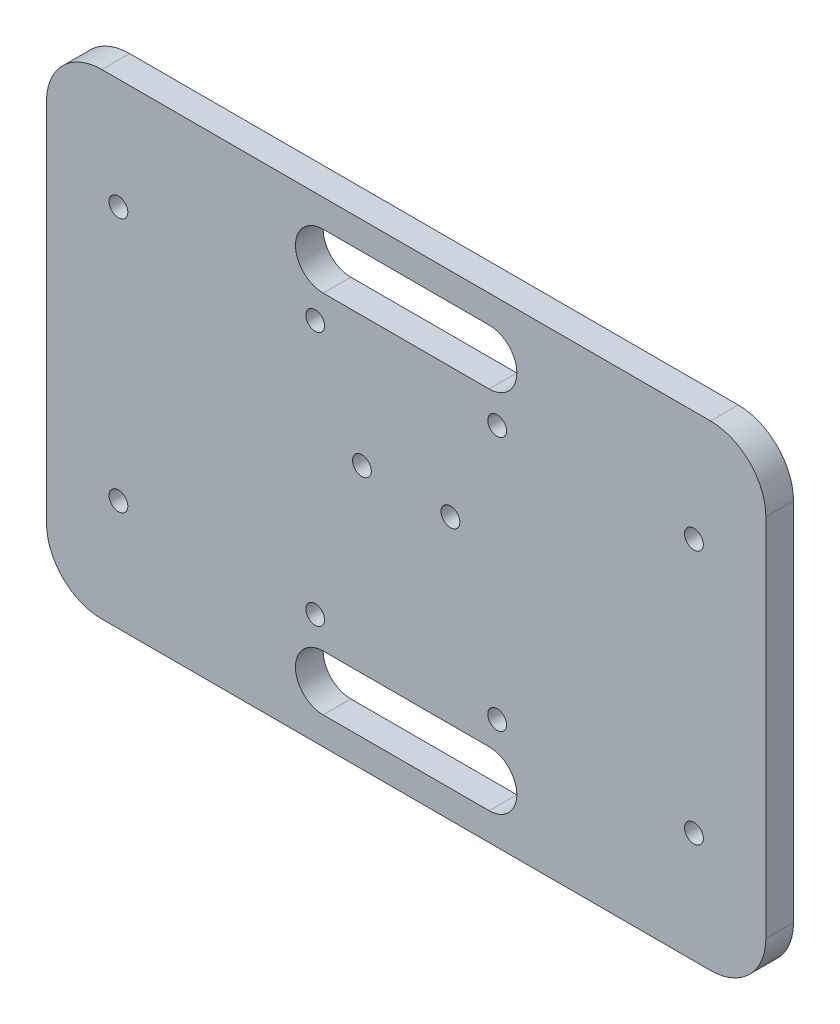
ISO-10303-21;
HEADER;
FILE_DESCRIPTION(('STEP AP214'),'2;1');
FILE_NAME('part.step','',(''),(''),'','','');
FILE_SCHEMA(('AUTOMOTIVE_DESIGN { 1 0 10303 214 1 1 1 1 }'));
ENDSEC;
DATA;
#1=APPLICATION_CONTEXT('core data for automotive mechanical design processes');
#2=APPLICATION_PROTOCOL_DEFINITION('international standard','automotive_design',2000,#1);
#3=PRODUCT_CONTEXT('',#1,'mechanical');
#4=PRODUCT('Part','Part','',(#3));
#5=PRODUCT_RELATED_PRODUCT_CATEGORY('part','',(#4));
#6=PRODUCT_DEFINITION_FORMATION('','',#4);
#7=PRODUCT_DEFINITION_CONTEXT('part definition',#1,'design');
#8=PRODUCT_DEFINITION('design','',#6,#7);
#9=PRODUCT_DEFINITION_SHAPE('','',#8);
#10=(LENGTH_UNIT() NAMED_UNIT(*) SI_UNIT(.MILLI.,.METRE.));
#11=(NAMED_UNIT(*) PLANE_ANGLE_UNIT() SI_UNIT($,.RADIAN.));
#12=(NAMED_UNIT(*) SI_UNIT($,.STERADIAN.) SOLID_ANGLE_UNIT());
#13=UNCERTAINTY_MEASURE_WITH_UNIT(LENGTH_MEASURE(1.E-05),#10,'distance_accuracy_value','');
#14=(GEOMETRIC_REPRESENTATION_CONTEXT(3) GLOBAL_UNCERTAINTY_ASSIGNED_CONTEXT((#13)) GLOBAL_UNIT_ASSIGNED_CONTEXT((#10,
#11,#12)) REPRESENTATION_CONTEXT('',''));
#15=CARTESIAN_POINT('',(0.,0.,0.));
#16=DIRECTION('',(0.,0.,1.));
#17=DIRECTION('',(1.,0.,0.));
#18=AXIS2_PLACEMENT_3D('',#15,#16,#17);
#19=CARTESIAN_POINT('',(15.,33.,5.));
#20=DIRECTION('',(0.,0.,-1.));
#21=DIRECTION('',(-1.,0.,0.));
#22=AXIS2_PLACEMENT_3D('',#19,#20,#21);
#23=CYLINDRICAL_SURFACE('',#22,5.);
#24=CARTESIAN_POINT('',(15.,33.,0.));
#25=DIRECTION('',(0.,0.,1.));
#26=DIRECTION('',(1.,0.,0.));
#27=AXIS2_PLACEMENT_3D('',#24,#25,#26);
#28=CIRCLE('',#27,5.);
#29=CARTESIAN_POINT('',(15.,28.,0.));
#30=VERTEX_POINT('',#29);
#31=CARTESIAN_POINT('',(15.,38.,0.));
#32=VERTEX_POINT('',#31);
#33=EDGE_CURVE('E249',#30,#32,#28,.T.);
#34=ORIENTED_EDGE('',*,*,#33,.F.);
#35=DIRECTION('',(0.,0.,-1.));
#36=VECTOR('',#35,1.);
#37=CARTESIAN_POINT('',(15.,28.,5.));
#38=LINE('',#37,#36);
#39=CARTESIAN_POINT('',(15.,28.,5.));
#40=VERTEX_POINT('',#39);
#41=EDGE_CURVE('E11',#40,#30,#38,.T.);
#42=ORIENTED_EDGE('',*,*,#41,.F.);
#43=CARTESIAN_POINT('',(15.,33.,5.));
#44=DIRECTION('',(0.,0.,1.));
#45=DIRECTION('',(1.,0.,0.));
#46=AXIS2_PLACEMENT_3D('',#43,#44,#45);
#47=CIRCLE('',#46,5.);
#48=CARTESIAN_POINT('',(15.,38.,5.));
#49=VERTEX_POINT('',#48);
#50=EDGE_CURVE('E176',#40,#49,#47,.T.);
#51=ORIENTED_EDGE('',*,*,#50,.T.);
#52=DIRECTION('',(0.,0.,-1.));
#53=VECTOR('',#52,1.);
#54=CARTESIAN_POINT('',(15.,38.,5.));
#55=LINE('',#54,#53);
#56=EDGE_CURVE('E116',#49,#32,#55,.T.);
#57=ORIENTED_EDGE('',*,*,#56,.T.);
#58=EDGE_LOOP('',(#34,#42,#51,#57));
#59=FACE_BOUND('',#58,.T.);
#60=ADVANCED_FACE('F39',(#59),#23,.F.);
#61=CARTESIAN_POINT('',(0.,28.,5.));
#62=DIRECTION('',(0.,1.,0.));
#63=DIRECTION('',(-1.,0.,0.));
#64=AXIS2_PLACEMENT_3D('',#61,#62,#63);
#65=PLANE('',#64);
#66=DIRECTION('',(1.,0.,0.));
#67=VECTOR('',#66,1.);
#68=CARTESIAN_POINT('',(0.,28.,0.));
#69=LINE('',#68,#67);
#70=CARTESIAN_POINT('',(-15.,28.,0.));
#71=VERTEX_POINT('',#70);
#72=EDGE_CURVE('E168',#71,#30,#69,.T.);
#73=ORIENTED_EDGE('',*,*,#72,.F.);
#74=DIRECTION('',(0.,0.,-1.));
#75=VECTOR('',#74,1.);
#76=CARTESIAN_POINT('',(-15.,28.,5.));
#77=LINE('',#76,#75);
#78=CARTESIAN_POINT('',(-15.,28.,5.));
#79=VERTEX_POINT('',#78);
#80=EDGE_CURVE('E49',#79,#71,#77,.T.);
#81=ORIENTED_EDGE('',*,*,#80,.F.);
#82=DIRECTION('',(1.,0.,0.));
#83=VECTOR('',#82,1.);
#84=CARTESIAN_POINT('',(0.,28.,5.));
#85=LINE('',#84,#83);
#86=EDGE_CURVE('E166',#79,#40,#85,.T.);
#87=ORIENTED_EDGE('',*,*,#86,.T.);
#88=ORIENTED_EDGE('',*,*,#41,.T.);
#89=EDGE_LOOP('',(#73,#81,#87,#88));
#90=FACE_BOUND('',#89,.T.);
#91=ADVANCED_FACE('F165',(#90),#65,.T.);
#92=CARTESIAN_POINT('',(-15.,33.,5.));
#93=DIRECTION('',(0.,0.,-1.));
#94=DIRECTION('',(-1.,0.,0.));
#95=AXIS2_PLACEMENT_3D('',#92,#93,#94);
#96=CYLINDRICAL_SURFACE('',#95,5.);
#97=CARTESIAN_POINT('',(-15.,33.,0.));
#98=DIRECTION('',(0.,0.,1.));
#99=DIRECTION('',(1.,0.,0.));
#100=AXIS2_PLACEMENT_3D('',#97,#98,#99);
#101=CIRCLE('',#100,5.);
#102=CARTESIAN_POINT('',(-15.,38.,0.));
#103=VERTEX_POINT('',#102);
#104=EDGE_CURVE('E253',#103,#71,#101,.T.);
#105=ORIENTED_EDGE('',*,*,#104,.F.);
#106=DIRECTION('',(0.,0.,-1.));
#107=VECTOR('',#106,1.);
#108=CARTESIAN_POINT('',(-15.,38.,5.));
#109=LINE('',#108,#107);
#110=CARTESIAN_POINT('',(-15.,38.,5.));
#111=VERTEX_POINT('',#110);
#112=EDGE_CURVE('E109',#111,#103,#109,.T.);
#113=ORIENTED_EDGE('',*,*,#112,.F.);
#114=CARTESIAN_POINT('',(-15.,33.,5.));
#115=DIRECTION('',(0.,0.,1.));
#116=DIRECTION('',(1.,0.,0.));
#117=AXIS2_PLACEMENT_3D('',#114,#115,#116);
#118=CIRCLE('',#117,5.);
#119=EDGE_CURVE('E175',#111,#79,#118,.T.);
#120=ORIENTED_EDGE('',*,*,#119,.T.);
#121=ORIENTED_EDGE('',*,*,#80,.T.);
#122=EDGE_LOOP('',(#105,#113,#120,#121));
#123=FACE_BOUND('',#122,.T.);
#124=ADVANCED_FACE('F178',(#123),#96,.F.);
#125=CARTESIAN_POINT('',(15.0000000000001,-33.,5.));
#126=DIRECTION('',(0.,0.,-1.));
#127=DIRECTION('',(-1.,0.,0.));
#128=AXIS2_PLACEMENT_3D('',#125,#126,#127);
#129=CYLINDRICAL_SURFACE('',#128,5.);
#130=CARTESIAN_POINT('',(15.0000000000001,-33.,0.));
#131=DIRECTION('',(0.,0.,1.));
#132=DIRECTION('',(1.,0.,0.));
#133=AXIS2_PLACEMENT_3D('',#130,#131,#132);
#134=CIRCLE('',#133,5.);
#135=CARTESIAN_POINT('',(15.0000000000001,-38.,0.));
#136=VERTEX_POINT('',#135);
#137=CARTESIAN_POINT('',(15.0000000000001,-28.,0.));
#138=VERTEX_POINT('',#137);
#139=EDGE_CURVE('E237',#136,#138,#134,.T.);
#140=ORIENTED_EDGE('',*,*,#139,.F.);
#141=DIRECTION('',(0.,0.,-1.));
#142=VECTOR('',#141,1.);
#143=CARTESIAN_POINT('',(15.0000000000001,-38.,5.));
#144=LINE('',#143,#142);
#145=CARTESIAN_POINT('',(15.0000000000001,-38.,5.));
#146=VERTEX_POINT('',#145);
#147=EDGE_CURVE('E259',#146,#136,#144,.T.);
#148=ORIENTED_EDGE('',*,*,#147,.F.);
#149=CARTESIAN_POINT('',(15.0000000000001,-33.,5.));
#150=DIRECTION('',(0.,0.,1.));
#151=DIRECTION('',(1.,0.,0.));
#152=AXIS2_PLACEMENT_3D('',#149,#150,#151);
#153=CIRCLE('',#152,5.);
#154=CARTESIAN_POINT('',(15.0000000000001,-28.,5.));
#155=VERTEX_POINT('',#154);
#156=EDGE_CURVE('E320',#146,#155,#153,.T.);
#157=ORIENTED_EDGE('',*,*,#156,.T.);
#158=DIRECTION('',(0.,0.,-1.));
#159=VECTOR('',#158,1.);
#160=CARTESIAN_POINT('',(15.0000000000001,-28.,5.));
#161=LINE('',#160,#159);
#162=EDGE_CURVE('E261',#155,#138,#161,.T.);
#163=ORIENTED_EDGE('',*,*,#162,.T.);
#164=EDGE_LOOP('',(#140,#148,#157,#163));
#165=FACE_BOUND('',#164,.T.);
#166=ADVANCED_FACE('F364',(#165),#129,.F.);
#167=CARTESIAN_POINT('',(0.,-38.,5.));
#168=DIRECTION('',(0.,1.,0.));
#169=DIRECTION('',(-1.,0.,0.));
#170=AXIS2_PLACEMENT_3D('',#167,#168,#169);
#171=PLANE('',#170);
#172=DIRECTION('',(1.,0.,0.));
#173=VECTOR('',#172,1.);
#174=CARTESIAN_POINT('',(0.,-38.,0.));
#175=LINE('',#174,#173);
#176=CARTESIAN_POINT('',(-15.,-38.,0.));
#177=VERTEX_POINT('',#176);
#178=EDGE_CURVE('E240',#177,#136,#175,.T.);
#179=ORIENTED_EDGE('',*,*,#178,.F.);
#180=DIRECTION('',(0.,0.,-1.));
#181=VECTOR('',#180,1.);
#182=CARTESIAN_POINT('',(-15.,-38.,5.));
#183=LINE('',#182,#181);
#184=CARTESIAN_POINT('',(-15.,-38.,5.));
#185=VERTEX_POINT('',#184);
#186=EDGE_CURVE('E265',#185,#177,#183,.T.);
#187=ORIENTED_EDGE('',*,*,#186,.F.);
#188=DIRECTION('',(1.,0.,0.));
#189=VECTOR('',#188,1.);
#190=CARTESIAN_POINT('',(0.,-38.,5.));
#191=LINE('',#190,#189);
#192=EDGE_CURVE('E323',#185,#146,#191,.T.);
#193=ORIENTED_EDGE('',*,*,#192,.T.);
#194=ORIENTED_EDGE('',*,*,#147,.T.);
#195=EDGE_LOOP('',(#179,#187,#193,#194));
#196=FACE_BOUND('',#195,.T.);
#197=ADVANCED_FACE('F360',(#196),#171,.T.);
#198=CARTESIAN_POINT('',(-15.,-33.,5.));
#199=DIRECTION('',(0.,0.,-1.));
#200=DIRECTION('',(-1.,0.,0.));
#201=AXIS2_PLACEMENT_3D('',#198,#199,#200);
#202=CYLINDRICAL_SURFACE('',#201,5.);
#203=CARTESIAN_POINT('',(-15.,-33.,0.));
#204=DIRECTION('',(0.,0.,1.));
#205=DIRECTION('',(1.,0.,0.));
#206=AXIS2_PLACEMENT_3D('',#203,#204,#205);
#207=CIRCLE('',#206,5.);
#208=CARTESIAN_POINT('',(-15.,-28.,0.));
#209=VERTEX_POINT('',#208);
#210=EDGE_CURVE('E243',#209,#177,#207,.T.);
#211=ORIENTED_EDGE('',*,*,#210,.F.);
#212=DIRECTION('',(0.,0.,-1.));
#213=VECTOR('',#212,1.);
#214=CARTESIAN_POINT('',(-15.,-28.,5.));
#215=LINE('',#214,#213);
#216=CARTESIAN_POINT('',(-15.,-28.,5.));
#217=VERTEX_POINT('',#216);
#218=EDGE_CURVE('E263',#217,#209,#215,.T.);
#219=ORIENTED_EDGE('',*,*,#218,.F.);
#220=CARTESIAN_POINT('',(-15.,-33.,5.));
#221=DIRECTION('',(0.,0.,1.));
#222=DIRECTION('',(1.,0.,0.));
#223=AXIS2_PLACEMENT_3D('',#220,#221,#222);
#224=CIRCLE('',#223,5.);
#225=EDGE_CURVE('E326',#217,#185,#224,.T.);
#226=ORIENTED_EDGE('',*,*,#225,.T.);
#227=ORIENTED_EDGE('',*,*,#186,.T.);
#228=EDGE_LOOP('',(#211,#219,#226,#227));
#229=FACE_BOUND('',#228,.T.);
#230=ADVANCED_FACE('F357',(#229),#202,.F.);
#231=CARTESIAN_POINT('',(55.,-33.,5.));
#232=DIRECTION('',(0.,0.,-1.));
#233=DIRECTION('',(-1.,0.,0.));
#234=AXIS2_PLACEMENT_3D('',#231,#232,#233);
#235=CYLINDRICAL_SURFACE('',#234,10.);
#236=CARTESIAN_POINT('',(55.,-33.,0.));
#237=DIRECTION('',(0.,0.,1.));
#238=DIRECTION('',(1.,0.,0.));
#239=AXIS2_PLACEMENT_3D('',#236,#237,#238);
#240=CIRCLE('',#239,10.);
#241=CARTESIAN_POINT('',(55.,-43.,0.));
#242=VERTEX_POINT('',#241);
#243=CARTESIAN_POINT('',(65.,-33.,0.));
#244=VERTEX_POINT('',#243);
#245=EDGE_CURVE('E214',#242,#244,#240,.T.);
#246=ORIENTED_EDGE('',*,*,#245,.T.);
#247=DIRECTION('',(0.,0.,-1.));
#248=VECTOR('',#247,1.);
#249=CARTESIAN_POINT('',(65.,-33.,5.));
#250=LINE('',#249,#248);
#251=CARTESIAN_POINT('',(65.,-33.,5.));
#252=VERTEX_POINT('',#251);
#253=EDGE_CURVE('E43',#252,#244,#250,.T.);
#254=ORIENTED_EDGE('',*,*,#253,.F.);
#255=CARTESIAN_POINT('',(55.,-33.,5.));
#256=DIRECTION('',(0.,0.,1.));
#257=DIRECTION('',(1.,0.,0.));
#258=AXIS2_PLACEMENT_3D('',#255,#256,#257);
#259=CIRCLE('',#258,10.);
#260=CARTESIAN_POINT('',(55.,-43.,5.));
#261=VERTEX_POINT('',#260);
#262=EDGE_CURVE('E124',#261,#252,#259,.T.);
#263=ORIENTED_EDGE('',*,*,#262,.F.);
#264=DIRECTION('',(0.,0.,-1.));
#265=VECTOR('',#264,1.);
#266=CARTESIAN_POINT('',(55.,-43.,5.));
#267=LINE('',#266,#265);
#268=EDGE_CURVE('E180',#261,#242,#267,.T.);
#269=ORIENTED_EDGE('',*,*,#268,.T.);
#270=EDGE_LOOP('',(#246,#254,#263,#269));
#271=FACE_BOUND('',#270,.T.);
#272=ADVANCED_FACE('F290',(#271),#235,.T.);
#273=CARTESIAN_POINT('',(65.,0.,5.));
#274=DIRECTION('',(1.,0.,0.));
#275=DIRECTION('',(0.,1.,0.));
#276=AXIS2_PLACEMENT_3D('',#273,#274,#275);
#277=PLANE('',#276);
#278=DIRECTION('',(0.,-1.,0.));
#279=VECTOR('',#278,1.);
#280=CARTESIAN_POINT('',(65.,0.,0.));
#281=LINE('',#280,#279);
#282=CARTESIAN_POINT('',(65.,33.,0.));
#283=VERTEX_POINT('',#282);
#284=EDGE_CURVE('E217',#283,#244,#281,.T.);
#285=ORIENTED_EDGE('',*,*,#284,.F.);
#286=DIRECTION('',(0.,0.,-1.));
#287=VECTOR('',#286,1.);
#288=CARTESIAN_POINT('',(65.,33.,5.));
#289=LINE('',#288,#287);
#290=CARTESIAN_POINT('',(65.,33.,5.));
#291=VERTEX_POINT('',#290);
#292=EDGE_CURVE('E279',#291,#283,#289,.T.);
#293=ORIENTED_EDGE('',*,*,#292,.F.);
#294=DIRECTION('',(0.,-1.,0.));
#295=VECTOR('',#294,1.);
#296=CARTESIAN_POINT('',(65.,0.,5.));
#297=LINE('',#296,#295);
#298=EDGE_CURVE('E287',#291,#252,#297,.T.);
#299=ORIENTED_EDGE('',*,*,#298,.T.);
#300=ORIENTED_EDGE('',*,*,#253,.T.);
#301=EDGE_LOOP('',(#285,#293,#299,#300));
#302=FACE_BOUND('',#301,.T.);
#303=ADVANCED_FACE('F286',(#302),#277,.T.);
#304=CARTESIAN_POINT('',(55.,33.,5.));
#305=DIRECTION('',(0.,0.,-1.));
#306=DIRECTION('',(-1.,0.,0.));
#307=AXIS2_PLACEMENT_3D('',#304,#305,#306);
#308=CYLINDRICAL_SURFACE('',#307,10.);
#309=CARTESIAN_POINT('',(55.,33.,0.));
#310=DIRECTION('',(0.,0.,1.));
#311=DIRECTION('',(1.,0.,0.));
#312=AXIS2_PLACEMENT_3D('',#309,#310,#311);
#313=CIRCLE('',#312,10.);
#314=CARTESIAN_POINT('',(55.,43.,0.));
#315=VERTEX_POINT('',#314);
#316=EDGE_CURVE('E220',#283,#315,#313,.T.);
#317=ORIENTED_EDGE('',*,*,#316,.T.);
#318=DIRECTION('',(0.,0.,-1.));
#319=VECTOR('',#318,1.);
#320=CARTESIAN_POINT('',(55.,43.,5.));
#321=LINE('',#320,#319);
#322=CARTESIAN_POINT('',(55.,43.,5.));
#323=VERTEX_POINT('',#322);
#324=EDGE_CURVE('E278',#323,#315,#321,.T.);
#325=ORIENTED_EDGE('',*,*,#324,.F.);
#326=CARTESIAN_POINT('',(55.,33.,5.));
#327=DIRECTION('',(0.,0.,1.));
#328=DIRECTION('',(1.,0.,0.));
#329=AXIS2_PLACEMENT_3D('',#326,#327,#328);
#330=CIRCLE('',#329,10.);
#331=EDGE_CURVE('E300',#291,#323,#330,.T.);
#332=ORIENTED_EDGE('',*,*,#331,.F.);
#333=ORIENTED_EDGE('',*,*,#292,.T.);
#334=EDGE_LOOP('',(#317,#325,#332,#333));
#335=FACE_BOUND('',#334,.T.);
#336=ADVANCED_FACE('F298',(#335),#308,.T.);
#337=CARTESIAN_POINT('',(0.,43.,5.));
#338=DIRECTION('',(0.,1.,0.));
#339=DIRECTION('',(-1.,0.,0.));
#340=AXIS2_PLACEMENT_3D('',#337,#338,#339);
#341=PLANE('',#340);
#342=DIRECTION('',(1.,0.,0.));
#343=VECTOR('',#342,1.);
#344=CARTESIAN_POINT('',(0.,43.,0.));
#345=LINE('',#344,#343);
#346=CARTESIAN_POINT('',(-55.,43.,0.));
#347=VERTEX_POINT('',#346);
#348=EDGE_CURVE('E223',#347,#315,#345,.T.);
#349=ORIENTED_EDGE('',*,*,#348,.F.);
#350=DIRECTION('',(0.,0.,-1.));
#351=VECTOR('',#350,1.);
#352=CARTESIAN_POINT('',(-55.,43.,5.));
#353=LINE('',#352,#351);
#354=CARTESIAN_POINT('',(-55.,43.,5.));
#355=VERTEX_POINT('',#354);
#356=EDGE_CURVE('E276',#355,#347,#353,.T.);
#357=ORIENTED_EDGE('',*,*,#356,.F.);
#358=DIRECTION('',(1.,0.,0.));
#359=VECTOR('',#358,1.);
#360=CARTESIAN_POINT('',(0.,43.,5.));
#361=LINE('',#360,#359);
#362=EDGE_CURVE('E303',#355,#323,#361,.T.);
#363=ORIENTED_EDGE('',*,*,#362,.T.);
#364=ORIENTED_EDGE('',*,*,#324,.T.);
#365=EDGE_LOOP('',(#349,#357,#363,#364));
#366=FACE_BOUND('',#365,.T.);
#367=ADVANCED_FACE('F304',(#366),#341,.T.);
#368=CARTESIAN_POINT('',(-55.,33.,5.));
#369=DIRECTION('',(0.,0.,-1.));
#370=DIRECTION('',(-1.,0.,0.));
#371=AXIS2_PLACEMENT_3D('',#368,#369,#370);
#372=CYLINDRICAL_SURFACE('',#371,10.);
#373=CARTESIAN_POINT('',(-55.,33.,0.));
#374=DIRECTION('',(0.,0.,1.));
#375=DIRECTION('',(1.,0.,0.));
#376=AXIS2_PLACEMENT_3D('',#373,#374,#375);
#377=CIRCLE('',#376,10.);
#378=CARTESIAN_POINT('',(-65.,33.,0.));
#379=VERTEX_POINT('',#378);
#380=EDGE_CURVE('E226',#379,#347,#377,.F.);
#381=ORIENTED_EDGE('',*,*,#380,.F.);
#382=DIRECTION('',(0.,0.,-1.));
#383=VECTOR('',#382,1.);
#384=CARTESIAN_POINT('',(-65.,33.,5.));
#385=LINE('',#384,#383);
#386=CARTESIAN_POINT('',(-65.,33.,5.));
#387=VERTEX_POINT('',#386);
#388=EDGE_CURVE('E274',#387,#379,#385,.T.);
#389=ORIENTED_EDGE('',*,*,#388,.F.);
#390=CARTESIAN_POINT('',(-55.,33.,5.));
#391=DIRECTION('',(0.,0.,1.));
#392=DIRECTION('',(1.,0.,0.));
#393=AXIS2_PLACEMENT_3D('',#390,#391,#392);
#394=CIRCLE('',#393,10.);
#395=EDGE_CURVE('E307',#387,#355,#394,.F.);
#396=ORIENTED_EDGE('',*,*,#395,.T.);
#397=ORIENTED_EDGE('',*,*,#356,.T.);
#398=EDGE_LOOP('',(#381,#389,#396,#397));
#399=FACE_BOUND('',#398,.T.);
#400=ADVANCED_FACE('F379',(#399),#372,.T.);
#401=CARTESIAN_POINT('',(-65.,0.,5.));
#402=DIRECTION('',(1.,0.,0.));
#403=DIRECTION('',(0.,0.,-1.));
#404=AXIS2_PLACEMENT_3D('',#401,#402,#403);
#405=PLANE('',#404);
#406=DIRECTION('',(0.,-1.,0.));
#407=VECTOR('',#406,1.);
#408=CARTESIAN_POINT('',(-65.,0.,0.));
#409=LINE('',#408,#407);
#410=CARTESIAN_POINT('',(-65.,-33.,0.));
#411=VERTEX_POINT('',#410);
#412=EDGE_CURVE('E229',#379,#411,#409,.T.);
#413=ORIENTED_EDGE('',*,*,#412,.T.);
#414=DIRECTION('',(0.,0.,-1.));
#415=VECTOR('',#414,1.);
#416=CARTESIAN_POINT('',(-65.,-33.,5.));
#417=LINE('',#416,#415);
#418=CARTESIAN_POINT('',(-65.,-33.,5.));
#419=VERTEX_POINT('',#418);
#420=EDGE_CURVE('E272',#419,#411,#417,.T.);
#421=ORIENTED_EDGE('',*,*,#420,.F.);
#422=DIRECTION('',(0.,-1.,0.));
#423=VECTOR('',#422,1.);
#424=CARTESIAN_POINT('',(-65.,0.,5.));
#425=LINE('',#424,#423);
#426=EDGE_CURVE('E309',#387,#419,#425,.T.);
#427=ORIENTED_EDGE('',*,*,#426,.F.);
#428=ORIENTED_EDGE('',*,*,#388,.T.);
#429=EDGE_LOOP('',(#413,#421,#427,#428));
#430=FACE_BOUND('',#429,.T.);
#431=ADVANCED_FACE('F375',(#430),#405,.F.);
#432=CARTESIAN_POINT('',(-55.,-33.,5.));
#433=DIRECTION('',(0.,0.,-1.));
#434=DIRECTION('',(-1.,0.,0.));
#435=AXIS2_PLACEMENT_3D('',#432,#433,#434);
#436=CYLINDRICAL_SURFACE('',#435,10.);
#437=CARTESIAN_POINT('',(-55.,-33.,0.));
#438=DIRECTION('',(0.,0.,1.));
#439=DIRECTION('',(1.,0.,0.));
#440=AXIS2_PLACEMENT_3D('',#437,#438,#439);
#441=CIRCLE('',#440,10.);
#442=CARTESIAN_POINT('',(-55.,-43.,0.));
#443=VERTEX_POINT('',#442);
#444=EDGE_CURVE('E232',#443,#411,#441,.F.);
#445=ORIENTED_EDGE('',*,*,#444,.F.);
#446=DIRECTION('',(0.,0.,-1.));
#447=VECTOR('',#446,1.);
#448=CARTESIAN_POINT('',(-55.,-43.,5.));
#449=LINE('',#448,#447);
#450=CARTESIAN_POINT('',(-55.,-43.,5.));
#451=VERTEX_POINT('',#450);
#452=EDGE_CURVE('E270',#451,#443,#449,.T.);
#453=ORIENTED_EDGE('',*,*,#452,.F.);
#454=CARTESIAN_POINT('',(-55.,-33.,5.));
#455=DIRECTION('',(0.,0.,1.));
#456=DIRECTION('',(1.,0.,0.));
#457=AXIS2_PLACEMENT_3D('',#454,#455,#456);
#458=CIRCLE('',#457,10.);
#459=EDGE_CURVE('E315',#451,#419,#458,.F.);
#460=ORIENTED_EDGE('',*,*,#459,.T.);
#461=ORIENTED_EDGE('',*,*,#420,.T.);
#462=EDGE_LOOP('',(#445,#453,#460,#461));
#463=FACE_BOUND('',#462,.T.);
#464=ADVANCED_FACE('F355',(#463),#436,.T.);
#465=CARTESIAN_POINT('',(0.,-28.,5.));
#466=DIRECTION('',(0.,1.,0.));
#467=DIRECTION('',(-1.,0.,0.));
#468=AXIS2_PLACEMENT_3D('',#465,#466,#467);
#469=PLANE('',#468);
#470=DIRECTION('',(1.,0.,0.));
#471=VECTOR('',#470,1.);
#472=CARTESIAN_POINT('',(0.,-28.,0.));
#473=LINE('',#472,#471);
#474=EDGE_CURVE('E246',#209,#138,#473,.T.);
#475=ORIENTED_EDGE('',*,*,#474,.T.);
#476=ORIENTED_EDGE('',*,*,#162,.F.);
#477=DIRECTION('',(1.,0.,0.));
#478=VECTOR('',#477,1.);
#479=CARTESIAN_POINT('',(0.,-28.,5.));
#480=LINE('',#479,#478);
#481=EDGE_CURVE('E329',#217,#155,#480,.T.);
#482=ORIENTED_EDGE('',*,*,#481,.F.);
#483=ORIENTED_EDGE('',*,*,#218,.T.);
#484=EDGE_LOOP('',(#475,#476,#482,#483));
#485=FACE_BOUND('',#484,.T.);
#486=ADVANCED_FACE('F351',(#485),#469,.F.);
#487=CARTESIAN_POINT('',(0.,-43.,5.));
#488=DIRECTION('',(0.,1.,0.));
#489=DIRECTION('',(-1.,0.,0.));
#490=AXIS2_PLACEMENT_3D('',#487,#488,#489);
#491=PLANE('',#490);
#492=DIRECTION('',(1.,0.,0.));
#493=VECTOR('',#492,1.);
#494=CARTESIAN_POINT('',(0.,-43.,0.));
#495=LINE('',#494,#493);
#496=EDGE_CURVE('E235',#443,#242,#495,.T.);
#497=ORIENTED_EDGE('',*,*,#496,.T.);
#498=ORIENTED_EDGE('',*,*,#268,.F.);
#499=DIRECTION('',(1.,0.,0.));
#500=VECTOR('',#499,1.);
#501=CARTESIAN_POINT('',(0.,-43.,5.));
#502=LINE('',#501,#500);
#503=EDGE_CURVE('E318',#451,#261,#502,.T.);
#504=ORIENTED_EDGE('',*,*,#503,.F.);
#505=ORIENTED_EDGE('',*,*,#452,.T.);
#506=EDGE_LOOP('',(#497,#498,#504,#505));
#507=FACE_BOUND('',#506,.T.);
#508=ADVANCED_FACE('F354',(#507),#491,.F.);
#509=CARTESIAN_POINT('',(8.,4.50000000000001,5.));
#510=DIRECTION('',(0.,0.,-1.));
#511=DIRECTION('',(-1.,0.,0.));
#512=AXIS2_PLACEMENT_3D('',#509,#510,#511);
#513=CYLINDRICAL_SURFACE('',#512,1.7);
#514=CARTESIAN_POINT('',(8.,4.50000000000001,5.));
#515=DIRECTION('',(0.,0.,1.));
#516=DIRECTION('',(1.,0.,0.));
#517=AXIS2_PLACEMENT_3D('',#514,#515,#516);
#518=CIRCLE('',#517,1.7);
#519=CARTESIAN_POINT('',(9.7,4.50000000000001,5.));
#520=VERTEX_POINT('',#519);
#521=EDGE_CURVE('E715',#520,#520,#518,.T.);
#522=ORIENTED_EDGE('',*,*,#521,.T.);
#523=EDGE_LOOP('',(#522));
#524=FACE_BOUND('',#523,.T.);
#525=CARTESIAN_POINT('',(8.,4.50000000000001,0.));
#526=DIRECTION('',(0.,0.,1.));
#527=DIRECTION('',(1.,0.,0.));
#528=AXIS2_PLACEMENT_3D('',#525,#526,#527);
#529=CIRCLE('',#528,1.7);
#530=CARTESIAN_POINT('',(9.7,4.50000000000001,0.));
#531=VERTEX_POINT('',#530);
#532=EDGE_CURVE('E211',#531,#531,#529,.T.);
#533=ORIENTED_EDGE('',*,*,#532,.F.);
#534=EDGE_LOOP('',(#533));
#535=FACE_BOUND('',#534,.T.);
#536=ADVANCED_FACE('F371',(#524,#535),#513,.F.);
#537=CARTESIAN_POINT('',(-8.,4.5,5.));
#538=DIRECTION('',(0.,0.,-1.));
#539=DIRECTION('',(-1.,0.,0.));
#540=AXIS2_PLACEMENT_3D('',#537,#538,#539);
#541=CYLINDRICAL_SURFACE('',#540,1.7);
#542=CARTESIAN_POINT('',(-8.,4.5,5.));
#543=DIRECTION('',(0.,0.,1.));
#544=DIRECTION('',(1.,0.,0.));
#545=AXIS2_PLACEMENT_3D('',#542,#543,#544);
#546=CIRCLE('',#545,1.7);
#547=CARTESIAN_POINT('',(-6.3,4.5,5.));
#548=VERTEX_POINT('',#547);
#549=EDGE_CURVE('E712',#548,#548,#546,.T.);
#550=ORIENTED_EDGE('',*,*,#549,.T.);
#551=EDGE_LOOP('',(#550));
#552=FACE_BOUND('',#551,.T.);
#553=CARTESIAN_POINT('',(-8.,4.5,0.));
#554=DIRECTION('',(0.,0.,1.));
#555=DIRECTION('',(1.,0.,0.));
#556=AXIS2_PLACEMENT_3D('',#553,#554,#555);
#557=CIRCLE('',#556,1.7);
#558=CARTESIAN_POINT('',(-6.3,4.5,0.));
#559=VERTEX_POINT('',#558);
#560=EDGE_CURVE('E208',#559,#559,#557,.T.);
#561=ORIENTED_EDGE('',*,*,#560,.F.);
#562=EDGE_LOOP('',(#561));
#563=FACE_BOUND('',#562,.T.);
#564=ADVANCED_FACE('F394',(#552,#563),#541,.F.);
#565=CARTESIAN_POINT('',(-16.44,-23.,5.));
#566=DIRECTION('',(0.,0.,-1.));
#567=DIRECTION('',(-1.,0.,0.));
#568=AXIS2_PLACEMENT_3D('',#565,#566,#567);
#569=CYLINDRICAL_SURFACE('',#568,1.7);
#570=CARTESIAN_POINT('',(-16.44,-23.,5.));
#571=DIRECTION('',(0.,0.,1.));
#572=DIRECTION('',(1.,0.,0.));
#573=AXIS2_PLACEMENT_3D('',#570,#571,#572);
#574=CIRCLE('',#573,1.7);
#575=CARTESIAN_POINT('',(-14.74,-23.,5.));
#576=VERTEX_POINT('',#575);
#577=EDGE_CURVE('E709',#576,#576,#574,.T.);
#578=ORIENTED_EDGE('',*,*,#577,.T.);
#579=EDGE_LOOP('',(#578));
#580=FACE_BOUND('',#579,.T.);
#581=CARTESIAN_POINT('',(-16.44,-23.,0.));
#582=DIRECTION('',(0.,0.,1.));
#583=DIRECTION('',(1.,0.,0.));
#584=AXIS2_PLACEMENT_3D('',#581,#582,#583);
#585=CIRCLE('',#584,1.7);
#586=CARTESIAN_POINT('',(-14.74,-23.,0.));
#587=VERTEX_POINT('',#586);
#588=EDGE_CURVE('E205',#587,#587,#585,.T.);
#589=ORIENTED_EDGE('',*,*,#588,.F.);
#590=EDGE_LOOP('',(#589));
#591=FACE_BOUND('',#590,.T.);
#592=ADVANCED_FACE('F398',(#580,#591),#569,.F.);
#593=CARTESIAN_POINT('',(-16.44,23.,5.));
#594=DIRECTION('',(0.,0.,-1.));
#595=DIRECTION('',(-1.,0.,0.));
#596=AXIS2_PLACEMENT_3D('',#593,#594,#595);
#597=CYLINDRICAL_SURFACE('',#596,1.7);
#598=CARTESIAN_POINT('',(-16.44,23.,5.));
#599=DIRECTION('',(0.,0.,1.));
#600=DIRECTION('',(1.,0.,0.));
#601=AXIS2_PLACEMENT_3D('',#598,#599,#600);
#602=CIRCLE('',#601,1.7);
#603=CARTESIAN_POINT('',(-14.74,23.,5.));
#604=VERTEX_POINT('',#603);
#605=EDGE_CURVE('E706',#604,#604,#602,.T.);
#606=ORIENTED_EDGE('',*,*,#605,.T.);
#607=EDGE_LOOP('',(#606));
#608=FACE_BOUND('',#607,.T.);
#609=CARTESIAN_POINT('',(-16.44,23.,0.));
#610=DIRECTION('',(0.,0.,1.));
#611=DIRECTION('',(1.,0.,0.));
#612=AXIS2_PLACEMENT_3D('',#609,#610,#611);
#613=CIRCLE('',#612,1.7);
#614=CARTESIAN_POINT('',(-14.74,23.,0.));
#615=VERTEX_POINT('',#614);
#616=EDGE_CURVE('E202',#615,#615,#613,.T.);
#617=ORIENTED_EDGE('',*,*,#616,.F.);
#618=EDGE_LOOP('',(#617));
#619=FACE_BOUND('',#618,.T.);
#620=ADVANCED_FACE('F402',(#608,#619),#597,.F.);
#621=CARTESIAN_POINT('',(16.44,-23.,5.));
#622=DIRECTION('',(0.,0.,-1.));
#623=DIRECTION('',(-1.,0.,0.));
#624=AXIS2_PLACEMENT_3D('',#621,#622,#623);
#625=CYLINDRICAL_SURFACE('',#624,1.7);
#626=CARTESIAN_POINT('',(16.44,-23.,5.));
#627=DIRECTION('',(0.,0.,1.));
#628=DIRECTION('',(1.,0.,0.));
#629=AXIS2_PLACEMENT_3D('',#626,#627,#628);
#630=CIRCLE('',#629,1.7);
#631=CARTESIAN_POINT('',(18.14,-23.,5.));
#632=VERTEX_POINT('',#631);
#633=EDGE_CURVE('E703',#632,#632,#630,.T.);
#634=ORIENTED_EDGE('',*,*,#633,.T.);
#635=EDGE_LOOP('',(#634));
#636=FACE_BOUND('',#635,.T.);
#637=CARTESIAN_POINT('',(16.44,-23.,0.));
#638=DIRECTION('',(0.,0.,1.));
#639=DIRECTION('',(1.,0.,0.));
#640=AXIS2_PLACEMENT_3D('',#637,#638,#639);
#641=CIRCLE('',#640,1.7);
#642=CARTESIAN_POINT('',(18.14,-23.,0.));
#643=VERTEX_POINT('',#642);
#644=EDGE_CURVE('E199',#643,#643,#641,.T.);
#645=ORIENTED_EDGE('',*,*,#644,.F.);
#646=EDGE_LOOP('',(#645));
#647=FACE_BOUND('',#646,.T.);
#648=ADVANCED_FACE('F406',(#636,#647),#625,.F.);
#649=CARTESIAN_POINT('',(16.44,23.,5.));
#650=DIRECTION('',(0.,0.,-1.));
#651=DIRECTION('',(-1.,0.,0.));
#652=AXIS2_PLACEMENT_3D('',#649,#650,#651);
#653=CYLINDRICAL_SURFACE('',#652,1.7);
#654=CARTESIAN_POINT('',(16.44,23.,5.));
#655=DIRECTION('',(0.,0.,1.));
#656=DIRECTION('',(1.,0.,0.));
#657=AXIS2_PLACEMENT_3D('',#654,#655,#656);
#658=CIRCLE('',#657,1.7);
#659=CARTESIAN_POINT('',(18.14,23.,5.));
#660=VERTEX_POINT('',#659);
#661=EDGE_CURVE('E700',#660,#660,#658,.T.);
#662=ORIENTED_EDGE('',*,*,#661,.T.);
#663=EDGE_LOOP('',(#662));
#664=FACE_BOUND('',#663,.T.);
#665=CARTESIAN_POINT('',(16.44,23.,0.));
#666=DIRECTION('',(0.,0.,1.));
#667=DIRECTION('',(1.,0.,0.));
#668=AXIS2_PLACEMENT_3D('',#665,#666,#667);
#669=CIRCLE('',#668,1.7);
#670=CARTESIAN_POINT('',(18.14,23.,0.));
#671=VERTEX_POINT('',#670);
#672=EDGE_CURVE('E196',#671,#671,#669,.T.);
#673=ORIENTED_EDGE('',*,*,#672,.F.);
#674=EDGE_LOOP('',(#673));
#675=FACE_BOUND('',#674,.T.);
#676=ADVANCED_FACE('F410',(#664,#675),#653,.F.);
#677=CARTESIAN_POINT('',(-52.,-23.,5.));
#678=DIRECTION('',(0.,0.,-1.));
#679=DIRECTION('',(-1.,0.,0.));
#680=AXIS2_PLACEMENT_3D('',#677,#678,#679);
#681=CYLINDRICAL_SURFACE('',#680,1.7);
#682=CARTESIAN_POINT('',(-52.,-23.,5.));
#683=DIRECTION('',(0.,0.,1.));
#684=DIRECTION('',(1.,0.,0.));
#685=AXIS2_PLACEMENT_3D('',#682,#683,#684);
#686=CIRCLE('',#685,1.7);
#687=CARTESIAN_POINT('',(-50.3,-23.,5.));
#688=VERTEX_POINT('',#687);
#689=EDGE_CURVE('E693',#688,#688,#686,.T.);
#690=ORIENTED_EDGE('',*,*,#689,.T.);
#691=EDGE_LOOP('',(#690));
#692=FACE_BOUND('',#691,.T.);
#693=CARTESIAN_POINT('',(-52.,-23.,0.));
#694=DIRECTION('',(0.,0.,1.));
#695=DIRECTION('',(1.,0.,0.));
#696=AXIS2_PLACEMENT_3D('',#693,#694,#695);
#697=CIRCLE('',#696,1.7);
#698=CARTESIAN_POINT('',(-50.3,-23.,0.));
#699=VERTEX_POINT('',#698);
#700=EDGE_CURVE('E193',#699,#699,#697,.T.);
#701=ORIENTED_EDGE('',*,*,#700,.F.);
#702=EDGE_LOOP('',(#701));
#703=FACE_BOUND('',#702,.T.);
#704=ADVANCED_FACE('F414',(#692,#703),#681,.F.);
#705=CARTESIAN_POINT('',(-52.,23.,5.));
#706=DIRECTION('',(0.,0.,-1.));
#707=DIRECTION('',(-1.,0.,0.));
#708=AXIS2_PLACEMENT_3D('',#705,#706,#707);
#709=CYLINDRICAL_SURFACE('',#708,1.7);
#710=CARTESIAN_POINT('',(-52.,23.,5.));
#711=DIRECTION('',(0.,0.,1.));
#712=DIRECTION('',(1.,0.,0.));
#713=AXIS2_PLACEMENT_3D('',#710,#711,#712);
#714=CIRCLE('',#713,1.7);
#715=CARTESIAN_POINT('',(-50.3,23.,5.));
#716=VERTEX_POINT('',#715);
#717=EDGE_CURVE('E690',#716,#716,#714,.T.);
#718=ORIENTED_EDGE('',*,*,#717,.T.);
#719=EDGE_LOOP('',(#718));
#720=FACE_BOUND('',#719,.T.);
#721=CARTESIAN_POINT('',(-52.,23.,0.));
#722=DIRECTION('',(0.,0.,1.));
#723=DIRECTION('',(1.,0.,0.));
#724=AXIS2_PLACEMENT_3D('',#721,#722,#723);
#725=CIRCLE('',#724,1.7);
#726=CARTESIAN_POINT('',(-50.3,23.,0.));
#727=VERTEX_POINT('',#726);
#728=EDGE_CURVE('E190',#727,#727,#725,.T.);
#729=ORIENTED_EDGE('',*,*,#728,.F.);
#730=EDGE_LOOP('',(#729));
#731=FACE_BOUND('',#730,.T.);
#732=ADVANCED_FACE('F418',(#720,#731),#709,.F.);
#733=CARTESIAN_POINT('',(52.,23.,5.));
#734=DIRECTION('',(0.,0.,-1.));
#735=DIRECTION('',(-1.,0.,0.));
#736=AXIS2_PLACEMENT_3D('',#733,#734,#735);
#737=CYLINDRICAL_SURFACE('',#736,1.7);
#738=CARTESIAN_POINT('',(52.,23.,5.));
#739=DIRECTION('',(0.,0.,1.));
#740=DIRECTION('',(1.,0.,0.));
#741=AXIS2_PLACEMENT_3D('',#738,#739,#740);
#742=CIRCLE('',#741,1.7);
#743=CARTESIAN_POINT('',(53.7,23.,5.));
#744=VERTEX_POINT('',#743);
#745=EDGE_CURVE('E429',#744,#744,#742,.T.);
#746=ORIENTED_EDGE('',*,*,#745,.T.);
#747=EDGE_LOOP('',(#746));
#748=FACE_BOUND('',#747,.T.);
#749=CARTESIAN_POINT('',(52.,23.,0.));
#750=DIRECTION('',(0.,0.,1.));
#751=DIRECTION('',(1.,0.,0.));
#752=AXIS2_PLACEMENT_3D('',#749,#750,#751);
#753=CIRCLE('',#752,1.7);
#754=CARTESIAN_POINT('',(53.7,23.,0.));
#755=VERTEX_POINT('',#754);
#756=EDGE_CURVE('E187',#755,#755,#753,.T.);
#757=ORIENTED_EDGE('',*,*,#756,.F.);
#758=EDGE_LOOP('',(#757));
#759=FACE_BOUND('',#758,.T.);
#760=ADVANCED_FACE('F340',(#748,#759),#737,.F.);
#761=CARTESIAN_POINT('',(52.,-23.,5.));
#762=DIRECTION('',(0.,0.,-1.));
#763=DIRECTION('',(-1.,0.,0.));
#764=AXIS2_PLACEMENT_3D('',#761,#762,#763);
#765=CYLINDRICAL_SURFACE('',#764,1.7);
#766=CARTESIAN_POINT('',(52.,-23.,5.));
#767=DIRECTION('',(0.,0.,1.));
#768=DIRECTION('',(1.,0.,0.));
#769=AXIS2_PLACEMENT_3D('',#766,#767,#768);
#770=CIRCLE('',#769,1.7);
#771=CARTESIAN_POINT('',(53.7,-23.,5.));
#772=VERTEX_POINT('',#771);
#773=EDGE_CURVE('E257',#772,#772,#770,.T.);
#774=ORIENTED_EDGE('',*,*,#773,.T.);
#775=EDGE_LOOP('',(#774));
#776=FACE_BOUND('',#775,.T.);
#777=CARTESIAN_POINT('',(52.,-23.,0.));
#778=DIRECTION('',(0.,0.,1.));
#779=DIRECTION('',(1.,0.,0.));
#780=AXIS2_PLACEMENT_3D('',#777,#778,#779);
#781=CIRCLE('',#780,1.7);
#782=CARTESIAN_POINT('',(53.7,-23.,0.));
#783=VERTEX_POINT('',#782);
#784=EDGE_CURVE('E184',#783,#783,#781,.T.);
#785=ORIENTED_EDGE('',*,*,#784,.F.);
#786=EDGE_LOOP('',(#785));
#787=FACE_BOUND('',#786,.T.);
#788=ADVANCED_FACE('F41',(#776,#787),#765,.F.);
#789=CARTESIAN_POINT('',(0.,38.,5.));
#790=DIRECTION('',(0.,1.,0.));
#791=DIRECTION('',(-1.,0.,0.));
#792=AXIS2_PLACEMENT_3D('',#789,#790,#791);
#793=PLANE('',#792);
#794=DIRECTION('',(1.,0.,0.));
#795=VECTOR('',#794,1.);
#796=CARTESIAN_POINT('',(0.,38.,0.));
#797=LINE('',#796,#795);
#798=EDGE_CURVE('E255',#103,#32,#797,.T.);
#799=ORIENTED_EDGE('',*,*,#798,.T.);
#800=ORIENTED_EDGE('',*,*,#56,.F.);
#801=DIRECTION('',(1.,0.,0.));
#802=VECTOR('',#801,1.);
#803=CARTESIAN_POINT('',(0.,38.,5.));
#804=LINE('',#803,#802);
#805=EDGE_CURVE('E58',#111,#49,#804,.T.);
#806=ORIENTED_EDGE('',*,*,#805,.F.);
#807=ORIENTED_EDGE('',*,*,#112,.T.);
#808=EDGE_LOOP('',(#799,#800,#806,#807));
#809=FACE_BOUND('',#808,.T.);
#810=ADVANCED_FACE('F331',(#809),#793,.F.);
#811=CARTESIAN_POINT('',(0.,0.,5.));
#812=DIRECTION('',(0.,0.,1.));
#813=DIRECTION('',(1.,0.,0.));
#814=AXIS2_PLACEMENT_3D('',#811,#812,#813);
#815=PLANE('',#814);
#816=ORIENTED_EDGE('',*,*,#773,.F.);
#817=EDGE_LOOP('',(#816));
#818=FACE_BOUND('',#817,.T.);
#819=ORIENTED_EDGE('',*,*,#745,.F.);
#820=EDGE_LOOP('',(#819));
#821=FACE_BOUND('',#820,.T.);
#822=ORIENTED_EDGE('',*,*,#717,.F.);
#823=EDGE_LOOP('',(#822));
#824=FACE_BOUND('',#823,.T.);
#825=ORIENTED_EDGE('',*,*,#689,.F.);
#826=EDGE_LOOP('',(#825));
#827=FACE_BOUND('',#826,.T.);
#828=ORIENTED_EDGE('',*,*,#661,.F.);
#829=EDGE_LOOP('',(#828));
#830=FACE_BOUND('',#829,.T.);
#831=ORIENTED_EDGE('',*,*,#633,.F.);
#832=EDGE_LOOP('',(#831));
#833=FACE_BOUND('',#832,.T.);
#834=ORIENTED_EDGE('',*,*,#605,.F.);
#835=EDGE_LOOP('',(#834));
#836=FACE_BOUND('',#835,.T.);
#837=ORIENTED_EDGE('',*,*,#577,.F.);
#838=EDGE_LOOP('',(#837));
#839=FACE_BOUND('',#838,.T.);
#840=ORIENTED_EDGE('',*,*,#549,.F.);
#841=EDGE_LOOP('',(#840));
#842=FACE_BOUND('',#841,.T.);
#843=ORIENTED_EDGE('',*,*,#521,.F.);
#844=EDGE_LOOP('',(#843));
#845=FACE_BOUND('',#844,.T.);
#846=ORIENTED_EDGE('',*,*,#262,.T.);
#847=ORIENTED_EDGE('',*,*,#298,.F.);
#848=ORIENTED_EDGE('',*,*,#331,.T.);
#849=ORIENTED_EDGE('',*,*,#362,.F.);
#850=ORIENTED_EDGE('',*,*,#395,.F.);
#851=ORIENTED_EDGE('',*,*,#426,.T.);
#852=ORIENTED_EDGE('',*,*,#459,.F.);
#853=ORIENTED_EDGE('',*,*,#503,.T.);
#854=EDGE_LOOP('',(#846,#847,#848,#849,#850,#851,#852,#853));
#855=FACE_BOUND('',#854,.T.);
#856=ORIENTED_EDGE('',*,*,#156,.F.);
#857=ORIENTED_EDGE('',*,*,#192,.F.);
#858=ORIENTED_EDGE('',*,*,#225,.F.);
#859=ORIENTED_EDGE('',*,*,#481,.T.);
#860=EDGE_LOOP('',(#856,#857,#858,#859));
#861=FACE_BOUND('',#860,.T.);
#862=ORIENTED_EDGE('',*,*,#50,.F.);
#863=ORIENTED_EDGE('',*,*,#86,.F.);
#864=ORIENTED_EDGE('',*,*,#119,.F.);
#865=ORIENTED_EDGE('',*,*,#805,.T.);
#866=EDGE_LOOP('',(#862,#863,#864,#865));
#867=FACE_BOUND('',#866,.T.);
#868=ADVANCED_FACE('F174',(#818,#821,#824,#827,#830,#833,#836,#839,#842,#845,#855,#861,#867),
#815,.T.);
#869=CARTESIAN_POINT('',(0.,0.,0.));
#870=DIRECTION('',(0.,0.,1.));
#871=DIRECTION('',(1.,0.,0.));
#872=AXIS2_PLACEMENT_3D('',#869,#870,#871);
#873=PLANE('',#872);
#874=ORIENTED_EDGE('',*,*,#784,.T.);
#875=EDGE_LOOP('',(#874));
#876=FACE_BOUND('',#875,.T.);
#877=ORIENTED_EDGE('',*,*,#756,.T.);
#878=EDGE_LOOP('',(#877));
#879=FACE_BOUND('',#878,.T.);
#880=ORIENTED_EDGE('',*,*,#728,.T.);
#881=EDGE_LOOP('',(#880));
#882=FACE_BOUND('',#881,.T.);
#883=ORIENTED_EDGE('',*,*,#700,.T.);
#884=EDGE_LOOP('',(#883));
#885=FACE_BOUND('',#884,.T.);
#886=ORIENTED_EDGE('',*,*,#672,.T.);
#887=EDGE_LOOP('',(#886));
#888=FACE_BOUND('',#887,.T.);
#889=ORIENTED_EDGE('',*,*,#644,.T.);
#890=EDGE_LOOP('',(#889));
#891=FACE_BOUND('',#890,.T.);
#892=ORIENTED_EDGE('',*,*,#616,.T.);
#893=EDGE_LOOP('',(#892));
#894=FACE_BOUND('',#893,.T.);
#895=ORIENTED_EDGE('',*,*,#588,.T.);
#896=EDGE_LOOP('',(#895));
#897=FACE_BOUND('',#896,.T.);
#898=ORIENTED_EDGE('',*,*,#560,.T.);
#899=EDGE_LOOP('',(#898));
#900=FACE_BOUND('',#899,.T.);
#901=ORIENTED_EDGE('',*,*,#532,.T.);
#902=EDGE_LOOP('',(#901));
#903=FACE_BOUND('',#902,.T.);
#904=ORIENTED_EDGE('',*,*,#245,.F.);
#905=ORIENTED_EDGE('',*,*,#496,.F.);
#906=ORIENTED_EDGE('',*,*,#444,.T.);
#907=ORIENTED_EDGE('',*,*,#412,.F.);
#908=ORIENTED_EDGE('',*,*,#380,.T.);
#909=ORIENTED_EDGE('',*,*,#348,.T.);
#910=ORIENTED_EDGE('',*,*,#316,.F.);
#911=ORIENTED_EDGE('',*,*,#284,.T.);
#912=EDGE_LOOP('',(#904,#905,#906,#907,#908,#909,#910,#911));
#913=FACE_BOUND('',#912,.T.);
#914=ORIENTED_EDGE('',*,*,#139,.T.);
#915=ORIENTED_EDGE('',*,*,#474,.F.);
#916=ORIENTED_EDGE('',*,*,#210,.T.);
#917=ORIENTED_EDGE('',*,*,#178,.T.);
#918=EDGE_LOOP('',(#914,#915,#916,#917));
#919=FACE_BOUND('',#918,.T.);
#920=ORIENTED_EDGE('',*,*,#33,.T.);
#921=ORIENTED_EDGE('',*,*,#798,.F.);
#922=ORIENTED_EDGE('',*,*,#104,.T.);
#923=ORIENTED_EDGE('',*,*,#72,.T.);
#924=EDGE_LOOP('',(#920,#921,#922,#923));
#925=FACE_BOUND('',#924,.T.);
#926=ADVANCED_FACE('F294',(#876,#879,#882,#885,#888,#891,#894,#897,#900,#903,#913,#919,#925),
#873,.F.);
#927=CLOSED_SHELL('',(#60,#91,#124,#166,#197,#230,#272,#303,#336,#367,#400,#431,#464,#486,#508,
#536,#564,#592,#620,#648,#676,#704,#732,#760,#788,#810,#868,#926));
#928=MANIFOLD_SOLID_BREP('B2',#927);
#929=ADVANCED_BREP_SHAPE_REPRESENTATION('',(#18,#928),#14);
#930=SHAPE_DEFINITION_REPRESENTATION(#9,#929);
ENDSEC;
END-ISO-10303-21;
